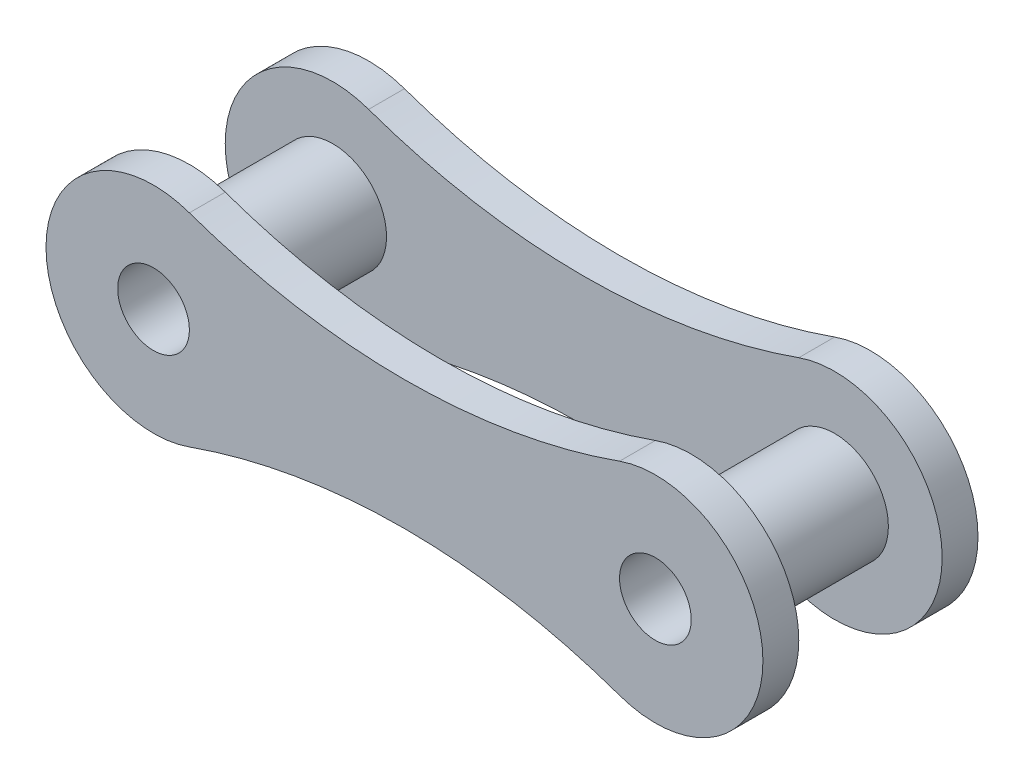
ISO-10303-21;
HEADER;
FILE_DESCRIPTION(('STEP AP214'),'2;1');
FILE_NAME('part.step','',(''),(''),'','','');
FILE_SCHEMA(('AUTOMOTIVE_DESIGN { 1 0 10303 214 1 1 1 1 }'));
ENDSEC;
DATA;
#1=APPLICATION_CONTEXT('core data for automotive mechanical design processes');
#2=APPLICATION_PROTOCOL_DEFINITION('international standard','automotive_design',2000,#1);
#3=PRODUCT_CONTEXT('',#1,'mechanical');
#4=PRODUCT('Part','Part','',(#3));
#5=PRODUCT_RELATED_PRODUCT_CATEGORY('part','',(#4));
#6=PRODUCT_DEFINITION_FORMATION('','',#4);
#7=PRODUCT_DEFINITION_CONTEXT('part definition',#1,'design');
#8=PRODUCT_DEFINITION('design','',#6,#7);
#9=PRODUCT_DEFINITION_SHAPE('','',#8);
#10=(LENGTH_UNIT() NAMED_UNIT(*) SI_UNIT(.MILLI.,.METRE.));
#11=(NAMED_UNIT(*) PLANE_ANGLE_UNIT() SI_UNIT($,.RADIAN.));
#12=(NAMED_UNIT(*) SI_UNIT($,.STERADIAN.) SOLID_ANGLE_UNIT());
#13=UNCERTAINTY_MEASURE_WITH_UNIT(LENGTH_MEASURE(1.E-05),#10,'distance_accuracy_value','');
#14=(GEOMETRIC_REPRESENTATION_CONTEXT(3) GLOBAL_UNCERTAINTY_ASSIGNED_CONTEXT((#13)) GLOBAL_UNIT_ASSIGNED_CONTEXT((#10,
#11,#12)) REPRESENTATION_CONTEXT('',''));
#15=CARTESIAN_POINT('',(0.,0.,0.));
#16=DIRECTION('',(0.,0.,1.));
#17=DIRECTION('',(1.,0.,0.));
#18=AXIS2_PLACEMENT_3D('',#15,#16,#17);
#19=CARTESIAN_POINT('',(0.,0.,1.));
#20=DIRECTION('',(0.,0.,1.));
#21=DIRECTION('',(1.,0.,0.));
#22=AXIS2_PLACEMENT_3D('',#19,#20,#21);
#23=PLANE('',#22);
#24=CARTESIAN_POINT('',(-7.,0.,1.));
#25=DIRECTION('',(0.,0.,1.));
#26=DIRECTION('',(1.,0.,0.));
#27=AXIS2_PLACEMENT_3D('',#24,#25,#26);
#28=CIRCLE('',#27,1.5);
#29=CARTESIAN_POINT('',(-5.5,0.,1.));
#30=VERTEX_POINT('',#29);
#31=EDGE_CURVE('E162',#30,#30,#28,.T.);
#32=ORIENTED_EDGE('',*,*,#31,.F.);
#33=EDGE_LOOP('',(#32));
#34=FACE_BOUND('',#33,.T.);
#35=CARTESIAN_POINT('',(0.,-19.7989898732233,1.));
#36=DIRECTION('',(0.,0.,1.));
#37=DIRECTION('',(1.,0.,0.));
#38=AXIS2_PLACEMENT_3D('',#35,#36,#37);
#39=CIRCLE('',#38,18.);
#40=CARTESIAN_POINT('',(6.,-2.8284271247462,1.));
#41=VERTEX_POINT('',#40);
#42=CARTESIAN_POINT('',(-6.,-2.8284271247462,1.));
#43=VERTEX_POINT('',#42);
#44=EDGE_CURVE('E166',#41,#43,#39,.T.);
#45=ORIENTED_EDGE('',*,*,#44,.F.);
#46=CARTESIAN_POINT('',(7.,0.,1.));
#47=DIRECTION('',(0.,0.,1.));
#48=DIRECTION('',(1.,0.,0.));
#49=AXIS2_PLACEMENT_3D('',#46,#47,#48);
#50=CIRCLE('',#49,3.);
#51=CARTESIAN_POINT('',(6.,2.82842712474618,1.));
#52=VERTEX_POINT('',#51);
#53=EDGE_CURVE('E168',#41,#52,#50,.T.);
#54=ORIENTED_EDGE('',*,*,#53,.T.);
#55=CARTESIAN_POINT('',(0.,19.7989898732233,1.));
#56=DIRECTION('',(0.,0.,1.));
#57=DIRECTION('',(1.,0.,0.));
#58=AXIS2_PLACEMENT_3D('',#55,#56,#57);
#59=CIRCLE('',#58,18.);
#60=CARTESIAN_POINT('',(-6.,2.82842712474618,1.));
#61=VERTEX_POINT('',#60);
#62=EDGE_CURVE('E171',#61,#52,#59,.T.);
#63=ORIENTED_EDGE('',*,*,#62,.F.);
#64=CARTESIAN_POINT('',(-7.,0.,1.));
#65=DIRECTION('',(0.,0.,1.));
#66=DIRECTION('',(1.,0.,0.));
#67=AXIS2_PLACEMENT_3D('',#64,#65,#66);
#68=CIRCLE('',#67,3.);
#69=EDGE_CURVE('E55',#61,#43,#68,.T.);
#70=ORIENTED_EDGE('',*,*,#69,.T.);
#71=EDGE_LOOP('',(#45,#54,#63,#70));
#72=FACE_BOUND('',#71,.T.);
#73=CARTESIAN_POINT('',(7.,0.,1.));
#74=DIRECTION('',(0.,0.,1.));
#75=DIRECTION('',(1.,0.,0.));
#76=AXIS2_PLACEMENT_3D('',#73,#74,#75);
#77=CIRCLE('',#76,1.5);
#78=CARTESIAN_POINT('',(8.5,0.,1.));
#79=VERTEX_POINT('',#78);
#80=EDGE_CURVE('E156',#79,#79,#77,.T.);
#81=ORIENTED_EDGE('',*,*,#80,.F.);
#82=EDGE_LOOP('',(#81));
#83=FACE_BOUND('',#82,.T.);
#84=ADVANCED_FACE('F37',(#34,#72,#83),#23,.T.);
#85=CARTESIAN_POINT('',(0.,-19.7989898732233,1.));
#86=DIRECTION('',(0.,0.,-1.));
#87=DIRECTION('',(-1.,0.,0.));
#88=AXIS2_PLACEMENT_3D('',#85,#86,#87);
#89=CYLINDRICAL_SURFACE('',#88,18.);
#90=CARTESIAN_POINT('',(0.,-19.7989898732233,0.));
#91=DIRECTION('',(0.,0.,1.));
#92=DIRECTION('',(1.,0.,0.));
#93=AXIS2_PLACEMENT_3D('',#90,#91,#92);
#94=CIRCLE('',#93,18.);
#95=CARTESIAN_POINT('',(6.,-2.8284271247462,0.));
#96=VERTEX_POINT('',#95);
#97=CARTESIAN_POINT('',(-6.,-2.8284271247462,0.));
#98=VERTEX_POINT('',#97);
#99=EDGE_CURVE('E165',#96,#98,#94,.T.);
#100=ORIENTED_EDGE('',*,*,#99,.F.);
#101=DIRECTION('',(0.,0.,-1.));
#102=VECTOR('',#101,1.);
#103=CARTESIAN_POINT('',(6.,-2.8284271247462,1.));
#104=LINE('',#103,#102);
#105=EDGE_CURVE('E11',#41,#96,#104,.T.);
#106=ORIENTED_EDGE('',*,*,#105,.F.);
#107=ORIENTED_EDGE('',*,*,#44,.T.);
#108=DIRECTION('',(0.,0.,-1.));
#109=VECTOR('',#108,1.);
#110=CARTESIAN_POINT('',(-6.,-2.8284271247462,1.));
#111=LINE('',#110,#109);
#112=EDGE_CURVE('E78',#43,#98,#111,.T.);
#113=ORIENTED_EDGE('',*,*,#112,.T.);
#114=EDGE_LOOP('',(#100,#106,#107,#113));
#115=FACE_BOUND('',#114,.T.);
#116=ADVANCED_FACE('F39',(#115),#89,.F.);
#117=CARTESIAN_POINT('',(7.,0.,1.));
#118=DIRECTION('',(0.,0.,-1.));
#119=DIRECTION('',(-1.,0.,0.));
#120=AXIS2_PLACEMENT_3D('',#117,#118,#119);
#121=CYLINDRICAL_SURFACE('',#120,3.);
#122=CARTESIAN_POINT('',(7.,0.,0.));
#123=DIRECTION('',(0.,0.,1.));
#124=DIRECTION('',(1.,0.,0.));
#125=AXIS2_PLACEMENT_3D('',#122,#123,#124);
#126=CIRCLE('',#125,3.);
#127=CARTESIAN_POINT('',(6.,2.82842712474618,0.));
#128=VERTEX_POINT('',#127);
#129=EDGE_CURVE('E177',#96,#128,#126,.T.);
#130=ORIENTED_EDGE('',*,*,#129,.T.);
#131=DIRECTION('',(0.,0.,-1.));
#132=VECTOR('',#131,1.);
#133=CARTESIAN_POINT('',(6.,2.82842712474618,1.));
#134=LINE('',#133,#132);
#135=EDGE_CURVE('E47',#52,#128,#134,.T.);
#136=ORIENTED_EDGE('',*,*,#135,.F.);
#137=ORIENTED_EDGE('',*,*,#53,.F.);
#138=ORIENTED_EDGE('',*,*,#105,.T.);
#139=EDGE_LOOP('',(#130,#136,#137,#138));
#140=FACE_BOUND('',#139,.T.);
#141=ADVANCED_FACE('F198',(#140),#121,.T.);
#142=CARTESIAN_POINT('',(0.,19.7989898732233,1.));
#143=DIRECTION('',(0.,0.,-1.));
#144=DIRECTION('',(-1.,0.,0.));
#145=AXIS2_PLACEMENT_3D('',#142,#143,#144);
#146=CYLINDRICAL_SURFACE('',#145,18.);
#147=CARTESIAN_POINT('',(0.,19.7989898732233,0.));
#148=DIRECTION('',(0.,0.,1.));
#149=DIRECTION('',(1.,0.,0.));
#150=AXIS2_PLACEMENT_3D('',#147,#148,#149);
#151=CIRCLE('',#150,18.);
#152=CARTESIAN_POINT('',(-6.,2.82842712474618,0.));
#153=VERTEX_POINT('',#152);
#154=EDGE_CURVE('E180',#153,#128,#151,.T.);
#155=ORIENTED_EDGE('',*,*,#154,.F.);
#156=DIRECTION('',(0.,0.,-1.));
#157=VECTOR('',#156,1.);
#158=CARTESIAN_POINT('',(-6.,2.82842712474618,1.));
#159=LINE('',#158,#157);
#160=EDGE_CURVE('E71',#61,#153,#159,.T.);
#161=ORIENTED_EDGE('',*,*,#160,.F.);
#162=ORIENTED_EDGE('',*,*,#62,.T.);
#163=ORIENTED_EDGE('',*,*,#135,.T.);
#164=EDGE_LOOP('',(#155,#161,#162,#163));
#165=FACE_BOUND('',#164,.T.);
#166=ADVANCED_FACE('F195',(#165),#146,.F.);
#167=CARTESIAN_POINT('',(7.,0.,1.));
#168=DIRECTION('',(0.,0.,-1.));
#169=DIRECTION('',(-1.,0.,0.));
#170=AXIS2_PLACEMENT_3D('',#167,#168,#169);
#171=CYLINDRICAL_SURFACE('',#170,1.);
#172=CARTESIAN_POINT('',(7.,0.,0.));
#173=DIRECTION('',(0.,0.,1.));
#174=DIRECTION('',(1.,0.,0.));
#175=AXIS2_PLACEMENT_3D('',#172,#173,#174);
#176=CIRCLE('',#175,1.);
#177=CARTESIAN_POINT('',(8.,0.,0.));
#178=VERTEX_POINT('',#177);
#179=EDGE_CURVE('E185',#178,#178,#176,.T.);
#180=ORIENTED_EDGE('',*,*,#179,.F.);
#181=EDGE_LOOP('',(#180));
#182=FACE_BOUND('',#181,.T.);
#183=CARTESIAN_POINT('',(7.,0.,6.));
#184=DIRECTION('',(0.,0.,1.));
#185=DIRECTION('',(1.,0.,0.));
#186=AXIS2_PLACEMENT_3D('',#183,#184,#185);
#187=CIRCLE('',#186,1.);
#188=CARTESIAN_POINT('',(8.,0.,6.));
#189=VERTEX_POINT('',#188);
#190=EDGE_CURVE('E153',#189,#189,#187,.T.);
#191=ORIENTED_EDGE('',*,*,#190,.T.);
#192=EDGE_LOOP('',(#191));
#193=FACE_BOUND('',#192,.T.);
#194=ADVANCED_FACE('F234',(#182,#193),#171,.F.);
#195=CARTESIAN_POINT('',(-7.,0.,1.));
#196=DIRECTION('',(0.,0.,-1.));
#197=DIRECTION('',(-1.,0.,0.));
#198=AXIS2_PLACEMENT_3D('',#195,#196,#197);
#199=CYLINDRICAL_SURFACE('',#198,3.);
#200=CARTESIAN_POINT('',(-7.,0.,0.));
#201=DIRECTION('',(0.,0.,1.));
#202=DIRECTION('',(1.,0.,0.));
#203=AXIS2_PLACEMENT_3D('',#200,#201,#202);
#204=CIRCLE('',#203,3.);
#205=EDGE_CURVE('E183',#153,#98,#204,.T.);
#206=ORIENTED_EDGE('',*,*,#205,.T.);
#207=ORIENTED_EDGE('',*,*,#112,.F.);
#208=ORIENTED_EDGE('',*,*,#69,.F.);
#209=ORIENTED_EDGE('',*,*,#160,.T.);
#210=EDGE_LOOP('',(#206,#207,#208,#209));
#211=FACE_BOUND('',#210,.T.);
#212=ADVANCED_FACE('F202',(#211),#199,.T.);
#213=CARTESIAN_POINT('',(-7.,0.,1.));
#214=DIRECTION('',(0.,0.,-1.));
#215=DIRECTION('',(-1.,0.,0.));
#216=AXIS2_PLACEMENT_3D('',#213,#214,#215);
#217=CYLINDRICAL_SURFACE('',#216,1.);
#218=CARTESIAN_POINT('',(-7.,0.,0.));
#219=DIRECTION('',(0.,0.,1.));
#220=DIRECTION('',(1.,0.,0.));
#221=AXIS2_PLACEMENT_3D('',#218,#219,#220);
#222=CIRCLE('',#221,1.);
#223=CARTESIAN_POINT('',(-6.,0.,0.));
#224=VERTEX_POINT('',#223);
#225=EDGE_CURVE('E169',#224,#224,#222,.T.);
#226=ORIENTED_EDGE('',*,*,#225,.F.);
#227=EDGE_LOOP('',(#226));
#228=FACE_BOUND('',#227,.T.);
#229=CARTESIAN_POINT('',(-7.,0.,6.));
#230=DIRECTION('',(0.,0.,1.));
#231=DIRECTION('',(1.,0.,0.));
#232=AXIS2_PLACEMENT_3D('',#229,#230,#231);
#233=CIRCLE('',#232,1.);
#234=CARTESIAN_POINT('',(-6.,0.,6.));
#235=VERTEX_POINT('',#234);
#236=EDGE_CURVE('E159',#235,#235,#233,.T.);
#237=ORIENTED_EDGE('',*,*,#236,.T.);
#238=EDGE_LOOP('',(#237));
#239=FACE_BOUND('',#238,.T.);
#240=ADVANCED_FACE('F230',(#228,#239),#217,.F.);
#241=CARTESIAN_POINT('',(0.,0.,0.));
#242=DIRECTION('',(0.,0.,1.));
#243=DIRECTION('',(1.,0.,0.));
#244=AXIS2_PLACEMENT_3D('',#241,#242,#243);
#245=PLANE('',#244);
#246=ORIENTED_EDGE('',*,*,#99,.T.);
#247=ORIENTED_EDGE('',*,*,#205,.F.);
#248=ORIENTED_EDGE('',*,*,#154,.T.);
#249=ORIENTED_EDGE('',*,*,#129,.F.);
#250=EDGE_LOOP('',(#246,#247,#248,#249));
#251=FACE_BOUND('',#250,.T.);
#252=ORIENTED_EDGE('',*,*,#179,.T.);
#253=EDGE_LOOP('',(#252));
#254=FACE_BOUND('',#253,.T.);
#255=ORIENTED_EDGE('',*,*,#225,.T.);
#256=EDGE_LOOP('',(#255));
#257=FACE_BOUND('',#256,.T.);
#258=ADVANCED_FACE('F200',(#251,#254,#257),#245,.F.);
#259=CARTESIAN_POINT('',(-7.,0.,6.));
#260=DIRECTION('',(0.,0.,1.));
#261=DIRECTION('',(1.,0.,0.));
#262=AXIS2_PLACEMENT_3D('',#259,#260,#261);
#263=PLANE('',#262);
#264=ORIENTED_EDGE('',*,*,#236,.F.);
#265=EDGE_LOOP('',(#264));
#266=FACE_BOUND('',#265,.T.);
#267=ORIENTED_EDGE('',*,*,#190,.F.);
#268=EDGE_LOOP('',(#267));
#269=FACE_BOUND('',#268,.T.);
#270=CARTESIAN_POINT('',(0.,-19.7989898732233,6.));
#271=DIRECTION('',(0.,0.,1.));
#272=DIRECTION('',(1.,0.,0.));
#273=AXIS2_PLACEMENT_3D('',#270,#271,#272);
#274=CIRCLE('',#273,18.);
#275=CARTESIAN_POINT('',(6.,-2.8284271247462,6.));
#276=VERTEX_POINT('',#275);
#277=CARTESIAN_POINT('',(-6.,-2.8284271247462,6.));
#278=VERTEX_POINT('',#277);
#279=EDGE_CURVE('E124',#276,#278,#274,.T.);
#280=ORIENTED_EDGE('',*,*,#279,.F.);
#281=CARTESIAN_POINT('',(7.,0.,6.));
#282=DIRECTION('',(0.,0.,1.));
#283=DIRECTION('',(1.,0.,0.));
#284=AXIS2_PLACEMENT_3D('',#281,#282,#283);
#285=CIRCLE('',#284,3.);
#286=CARTESIAN_POINT('',(6.,2.82842712474618,6.));
#287=VERTEX_POINT('',#286);
#288=EDGE_CURVE('E118',#276,#287,#285,.T.);
#289=ORIENTED_EDGE('',*,*,#288,.T.);
#290=CARTESIAN_POINT('',(0.,19.7989898732233,6.));
#291=DIRECTION('',(0.,0.,1.));
#292=DIRECTION('',(1.,0.,0.));
#293=AXIS2_PLACEMENT_3D('',#290,#291,#292);
#294=CIRCLE('',#293,18.);
#295=CARTESIAN_POINT('',(-6.,2.82842712474618,6.));
#296=VERTEX_POINT('',#295);
#297=EDGE_CURVE('E141',#296,#287,#294,.T.);
#298=ORIENTED_EDGE('',*,*,#297,.F.);
#299=CARTESIAN_POINT('',(-7.,0.,6.));
#300=DIRECTION('',(0.,0.,1.));
#301=DIRECTION('',(1.,0.,0.));
#302=AXIS2_PLACEMENT_3D('',#299,#300,#301);
#303=CIRCLE('',#302,3.);
#304=EDGE_CURVE('E139',#296,#278,#303,.T.);
#305=ORIENTED_EDGE('',*,*,#304,.T.);
#306=EDGE_LOOP('',(#280,#289,#298,#305));
#307=FACE_BOUND('',#306,.T.);
#308=ADVANCED_FACE('F219',(#266,#269,#307),#263,.T.);
#309=CARTESIAN_POINT('',(-7.,0.,6.));
#310=DIRECTION('',(0.,0.,-1.));
#311=DIRECTION('',(-1.,0.,0.));
#312=AXIS2_PLACEMENT_3D('',#309,#310,#311);
#313=CYLINDRICAL_SURFACE('',#312,1.5);
#314=CARTESIAN_POINT('',(-7.,0.,5.));
#315=DIRECTION('',(0.,0.,-1.));
#316=DIRECTION('',(-1.,0.,0.));
#317=AXIS2_PLACEMENT_3D('',#314,#315,#316);
#318=CIRCLE('',#317,1.5);
#319=CARTESIAN_POINT('',(-8.5,0.,5.));
#320=VERTEX_POINT('',#319);
#321=EDGE_CURVE('E150',#320,#320,#318,.T.);
#322=ORIENTED_EDGE('',*,*,#321,.T.);
#323=EDGE_LOOP('',(#322));
#324=FACE_BOUND('',#323,.T.);
#325=ORIENTED_EDGE('',*,*,#31,.T.);
#326=EDGE_LOOP('',(#325));
#327=FACE_BOUND('',#326,.T.);
#328=ADVANCED_FACE('F211',(#324,#327),#313,.T.);
#329=CARTESIAN_POINT('',(7.,0.,6.));
#330=DIRECTION('',(0.,0.,-1.));
#331=DIRECTION('',(-1.,0.,0.));
#332=AXIS2_PLACEMENT_3D('',#329,#330,#331);
#333=CYLINDRICAL_SURFACE('',#332,1.5);
#334=CARTESIAN_POINT('',(7.,0.,5.));
#335=DIRECTION('',(0.,0.,-1.));
#336=DIRECTION('',(-1.,0.,0.));
#337=AXIS2_PLACEMENT_3D('',#334,#335,#336);
#338=CIRCLE('',#337,1.5);
#339=CARTESIAN_POINT('',(5.5,0.,5.));
#340=VERTEX_POINT('',#339);
#341=EDGE_CURVE('E41',#340,#340,#338,.T.);
#342=ORIENTED_EDGE('',*,*,#341,.T.);
#343=EDGE_LOOP('',(#342));
#344=FACE_BOUND('',#343,.T.);
#345=ORIENTED_EDGE('',*,*,#80,.T.);
#346=EDGE_LOOP('',(#345));
#347=FACE_BOUND('',#346,.T.);
#348=ADVANCED_FACE('F209',(#344,#347),#333,.T.);
#349=CARTESIAN_POINT('',(0.,-19.7989898732233,5.));
#350=DIRECTION('',(0.,0.,1.));
#351=DIRECTION('',(1.,0.,0.));
#352=AXIS2_PLACEMENT_3D('',#349,#350,#351);
#353=CYLINDRICAL_SURFACE('',#352,18.);
#354=ORIENTED_EDGE('',*,*,#279,.T.);
#355=DIRECTION('',(0.,0.,1.));
#356=VECTOR('',#355,1.);
#357=CARTESIAN_POINT('',(-6.,-2.8284271247462,5.));
#358=LINE('',#357,#356);
#359=CARTESIAN_POINT('',(-6.,-2.8284271247462,5.));
#360=VERTEX_POINT('',#359);
#361=EDGE_CURVE('E121',#360,#278,#358,.T.);
#362=ORIENTED_EDGE('',*,*,#361,.F.);
#363=CARTESIAN_POINT('',(0.,-19.7989898732233,5.));
#364=DIRECTION('',(0.,0.,1.));
#365=DIRECTION('',(1.,0.,0.));
#366=AXIS2_PLACEMENT_3D('',#363,#364,#365);
#367=CIRCLE('',#366,18.);
#368=CARTESIAN_POINT('',(6.,-2.8284271247462,5.));
#369=VERTEX_POINT('',#368);
#370=EDGE_CURVE('E110',#369,#360,#367,.T.);
#371=ORIENTED_EDGE('',*,*,#370,.F.);
#372=DIRECTION('',(0.,0.,1.));
#373=VECTOR('',#372,1.);
#374=CARTESIAN_POINT('',(6.,-2.8284271247462,5.));
#375=LINE('',#374,#373);
#376=EDGE_CURVE('E137',#369,#276,#375,.T.);
#377=ORIENTED_EDGE('',*,*,#376,.T.);
#378=EDGE_LOOP('',(#354,#362,#371,#377));
#379=FACE_BOUND('',#378,.T.);
#380=ADVANCED_FACE('F122',(#379),#353,.F.);
#381=CARTESIAN_POINT('',(-7.,0.,5.));
#382=DIRECTION('',(0.,0.,1.));
#383=DIRECTION('',(1.,0.,0.));
#384=AXIS2_PLACEMENT_3D('',#381,#382,#383);
#385=CYLINDRICAL_SURFACE('',#384,3.);
#386=ORIENTED_EDGE('',*,*,#304,.F.);
#387=DIRECTION('',(0.,0.,1.));
#388=VECTOR('',#387,1.);
#389=CARTESIAN_POINT('',(-6.,2.82842712474618,5.));
#390=LINE('',#389,#388);
#391=CARTESIAN_POINT('',(-6.,2.82842712474618,5.));
#392=VERTEX_POINT('',#391);
#393=EDGE_CURVE('E128',#392,#296,#390,.T.);
#394=ORIENTED_EDGE('',*,*,#393,.F.);
#395=CARTESIAN_POINT('',(-7.,0.,5.));
#396=DIRECTION('',(0.,0.,1.));
#397=DIRECTION('',(1.,0.,0.));
#398=AXIS2_PLACEMENT_3D('',#395,#396,#397);
#399=CIRCLE('',#398,3.);
#400=EDGE_CURVE('E114',#392,#360,#399,.T.);
#401=ORIENTED_EDGE('',*,*,#400,.T.);
#402=ORIENTED_EDGE('',*,*,#361,.T.);
#403=EDGE_LOOP('',(#386,#394,#401,#402));
#404=FACE_BOUND('',#403,.T.);
#405=ADVANCED_FACE('F130',(#404),#385,.T.);
#406=CARTESIAN_POINT('',(0.,19.7989898732233,5.));
#407=DIRECTION('',(0.,0.,1.));
#408=DIRECTION('',(1.,0.,0.));
#409=AXIS2_PLACEMENT_3D('',#406,#407,#408);
#410=CYLINDRICAL_SURFACE('',#409,18.);
#411=ORIENTED_EDGE('',*,*,#297,.T.);
#412=DIRECTION('',(0.,0.,1.));
#413=VECTOR('',#412,1.);
#414=CARTESIAN_POINT('',(6.,2.82842712474618,5.));
#415=LINE('',#414,#413);
#416=CARTESIAN_POINT('',(6.,2.82842712474618,5.));
#417=VERTEX_POINT('',#416);
#418=EDGE_CURVE('E147',#417,#287,#415,.T.);
#419=ORIENTED_EDGE('',*,*,#418,.F.);
#420=CARTESIAN_POINT('',(0.,19.7989898732233,5.));
#421=DIRECTION('',(0.,0.,1.));
#422=DIRECTION('',(1.,0.,0.));
#423=AXIS2_PLACEMENT_3D('',#420,#421,#422);
#424=CIRCLE('',#423,18.);
#425=EDGE_CURVE('E132',#392,#417,#424,.T.);
#426=ORIENTED_EDGE('',*,*,#425,.F.);
#427=ORIENTED_EDGE('',*,*,#393,.T.);
#428=EDGE_LOOP('',(#411,#419,#426,#427));
#429=FACE_BOUND('',#428,.T.);
#430=ADVANCED_FACE('F304',(#429),#410,.F.);
#431=CARTESIAN_POINT('',(7.,0.,5.));
#432=DIRECTION('',(0.,0.,1.));
#433=DIRECTION('',(1.,0.,0.));
#434=AXIS2_PLACEMENT_3D('',#431,#432,#433);
#435=CYLINDRICAL_SURFACE('',#434,3.);
#436=ORIENTED_EDGE('',*,*,#288,.F.);
#437=ORIENTED_EDGE('',*,*,#376,.F.);
#438=CARTESIAN_POINT('',(7.,0.,5.));
#439=DIRECTION('',(0.,0.,1.));
#440=DIRECTION('',(1.,0.,0.));
#441=AXIS2_PLACEMENT_3D('',#438,#439,#440);
#442=CIRCLE('',#441,3.);
#443=EDGE_CURVE('E116',#369,#417,#442,.T.);
#444=ORIENTED_EDGE('',*,*,#443,.T.);
#445=ORIENTED_EDGE('',*,*,#418,.T.);
#446=EDGE_LOOP('',(#436,#437,#444,#445));
#447=FACE_BOUND('',#446,.T.);
#448=ADVANCED_FACE('F312',(#447),#435,.T.);
#449=CARTESIAN_POINT('',(0.,0.,5.));
#450=DIRECTION('',(0.,0.,-1.));
#451=DIRECTION('',(1.,0.,0.));
#452=AXIS2_PLACEMENT_3D('',#449,#450,#451);
#453=PLANE('',#452);
#454=ORIENTED_EDGE('',*,*,#321,.F.);
#455=EDGE_LOOP('',(#454));
#456=FACE_BOUND('',#455,.T.);
#457=ORIENTED_EDGE('',*,*,#341,.F.);
#458=EDGE_LOOP('',(#457));
#459=FACE_BOUND('',#458,.T.);
#460=ORIENTED_EDGE('',*,*,#370,.T.);
#461=ORIENTED_EDGE('',*,*,#400,.F.);
#462=ORIENTED_EDGE('',*,*,#425,.T.);
#463=ORIENTED_EDGE('',*,*,#443,.F.);
#464=EDGE_LOOP('',(#460,#461,#462,#463));
#465=FACE_BOUND('',#464,.T.);
#466=ADVANCED_FACE('F112',(#456,#459,#465),#453,.T.);
#467=CLOSED_SHELL('',(#84,#116,#141,#166,#194,#212,#240,#258,#308,#328,#348,#380,#405,#430,#448,#466));
#468=MANIFOLD_SOLID_BREP('B2',#467);
#469=ADVANCED_BREP_SHAPE_REPRESENTATION('',(#18,#468),#14);
#470=SHAPE_DEFINITION_REPRESENTATION(#9,#469);
ENDSEC;
END-ISO-10303-21;
